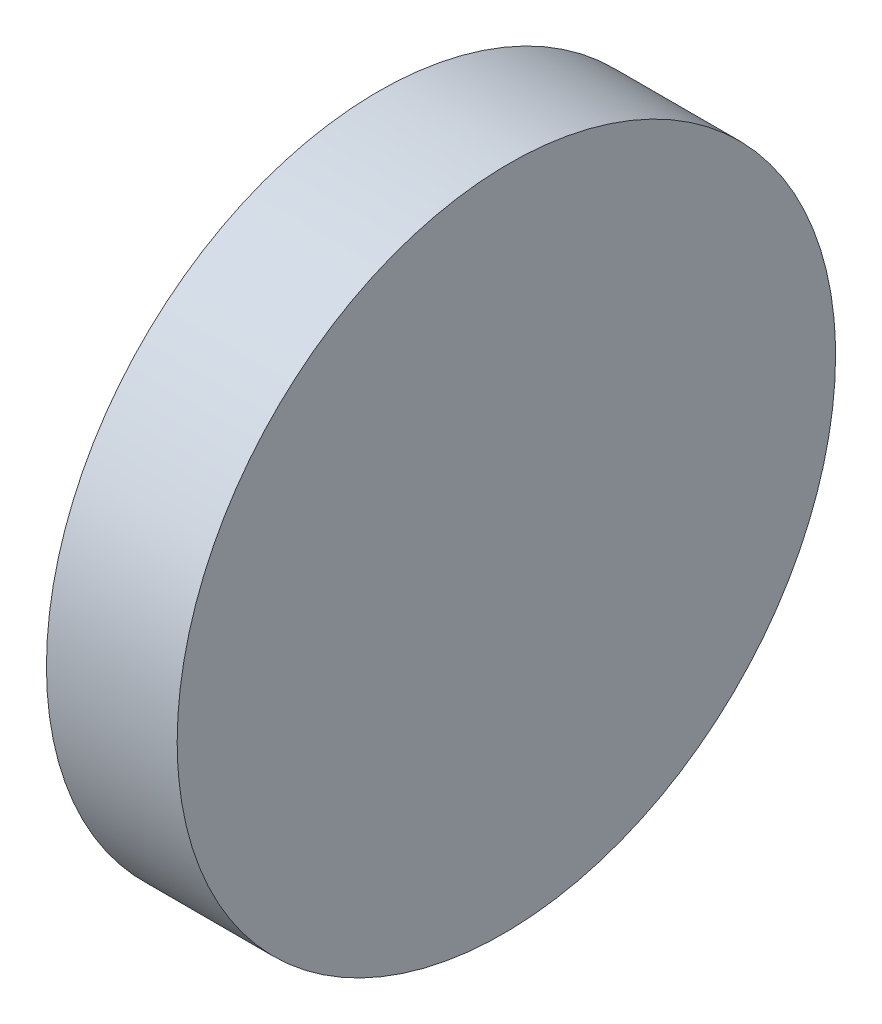
ISO-10303-21;
HEADER;
FILE_DESCRIPTION(('STEP AP214'),'2;1');
FILE_NAME('part.step','',(''),(''),'','','');
FILE_SCHEMA(('AUTOMOTIVE_DESIGN { 1 0 10303 214 1 1 1 1 }'));
ENDSEC;
DATA;
#1=APPLICATION_CONTEXT('core data for automotive mechanical design processes');
#2=APPLICATION_PROTOCOL_DEFINITION('international standard','automotive_design',2000,#1);
#3=PRODUCT_CONTEXT('',#1,'mechanical');
#4=PRODUCT('Part','Part','',(#3));
#5=PRODUCT_RELATED_PRODUCT_CATEGORY('part','',(#4));
#6=PRODUCT_DEFINITION_FORMATION('','',#4);
#7=PRODUCT_DEFINITION_CONTEXT('part definition',#1,'design');
#8=PRODUCT_DEFINITION('design','',#6,#7);
#9=PRODUCT_DEFINITION_SHAPE('','',#8);
#10=(LENGTH_UNIT() NAMED_UNIT(*) SI_UNIT(.MILLI.,.METRE.));
#11=(NAMED_UNIT(*) PLANE_ANGLE_UNIT() SI_UNIT($,.RADIAN.));
#12=(NAMED_UNIT(*) SI_UNIT($,.STERADIAN.) SOLID_ANGLE_UNIT());
#13=UNCERTAINTY_MEASURE_WITH_UNIT(LENGTH_MEASURE(1.E-05),#10,'distance_accuracy_value','');
#14=(GEOMETRIC_REPRESENTATION_CONTEXT(3) GLOBAL_UNCERTAINTY_ASSIGNED_CONTEXT((#13)) GLOBAL_UNIT_ASSIGNED_CONTEXT((#10,
#11,#12)) REPRESENTATION_CONTEXT('',''));
#15=CARTESIAN_POINT('',(0.,0.,0.));
#16=DIRECTION('',(0.,0.,1.));
#17=DIRECTION('',(1.,0.,0.));
#18=AXIS2_PLACEMENT_3D('',#15,#16,#17);
#19=CARTESIAN_POINT('',(0.,25.4,-12.7));
#20=DIRECTION('',(1.,0.,0.));
#21=DIRECTION('',(0.,0.,-1.));
#22=AXIS2_PLACEMENT_3D('',#19,#20,#21);
#23=PLANE('',#22);
#24=CARTESIAN_POINT('',(0.,12.7,0.));
#25=DIRECTION('',(-1.,0.,0.));
#26=DIRECTION('',(0.,0.,1.));
#27=AXIS2_PLACEMENT_3D('',#24,#25,#26);
#28=CIRCLE('',#27,12.7);
#29=CARTESIAN_POINT('',(0.,12.7,12.7));
#30=VERTEX_POINT('',#29);
#31=EDGE_CURVE('E75',#30,#30,#28,.T.);
#32=ORIENTED_EDGE('',*,*,#31,.T.);
#33=EDGE_LOOP('',(#32));
#34=FACE_BOUND('',#33,.T.);
#35=ADVANCED_FACE('F69',(#34),#23,.F.);
#36=CARTESIAN_POINT('',(5.,25.4,12.7));
#37=DIRECTION('',(-0.999961923064172,0.,0.00872653549836697));
#38=DIRECTION('',(0.00872653549836697,0.,0.999961923064171));
#39=AXIS2_PLACEMENT_3D('',#36,#37,#38);
#40=PLANE('',#39);
#41=CARTESIAN_POINT('',(4.88916877905745,12.7,0.));
#42=DIRECTION('',(-0.999961923064172,0.,0.00872653549836697));
#43=DIRECTION('',(-0.00872653549836697,0.,-0.999961923064171));
#44=AXIS2_PLACEMENT_3D('',#41,#42,#43);
#45=ELLIPSE('',#44,12.7004835954989,12.7);
#46=CARTESIAN_POINT('',(4.77833755811491,12.7,-12.7));
#47=VERTEX_POINT('',#46);
#48=EDGE_CURVE('E11',#47,#47,#45,.T.);
#49=ORIENTED_EDGE('',*,*,#48,.F.);
#50=EDGE_LOOP('',(#49));
#51=FACE_BOUND('',#50,.T.);
#52=ADVANCED_FACE('F84',(#51),#40,.F.);
#53=CARTESIAN_POINT('',(12.5,12.7,0.));
#54=DIRECTION('',(-1.,0.,0.));
#55=DIRECTION('',(0.,0.,1.));
#56=AXIS2_PLACEMENT_3D('',#53,#54,#55);
#57=CYLINDRICAL_SURFACE('',#56,12.7);
#58=ORIENTED_EDGE('',*,*,#31,.F.);
#59=EDGE_LOOP('',(#58));
#60=FACE_BOUND('',#59,.T.);
#61=ORIENTED_EDGE('',*,*,#48,.T.);
#62=EDGE_LOOP('',(#61));
#63=FACE_BOUND('',#62,.T.);
#64=ADVANCED_FACE('F82',(#60,#63),#57,.T.);
#65=CLOSED_SHELL('',(#35,#52,#64));
#66=MANIFOLD_SOLID_BREP('B2',#65);
#67=ADVANCED_BREP_SHAPE_REPRESENTATION('',(#18,#66),#14);
#68=SHAPE_DEFINITION_REPRESENTATION(#9,#67);
ENDSEC;
END-ISO-10303-21;
